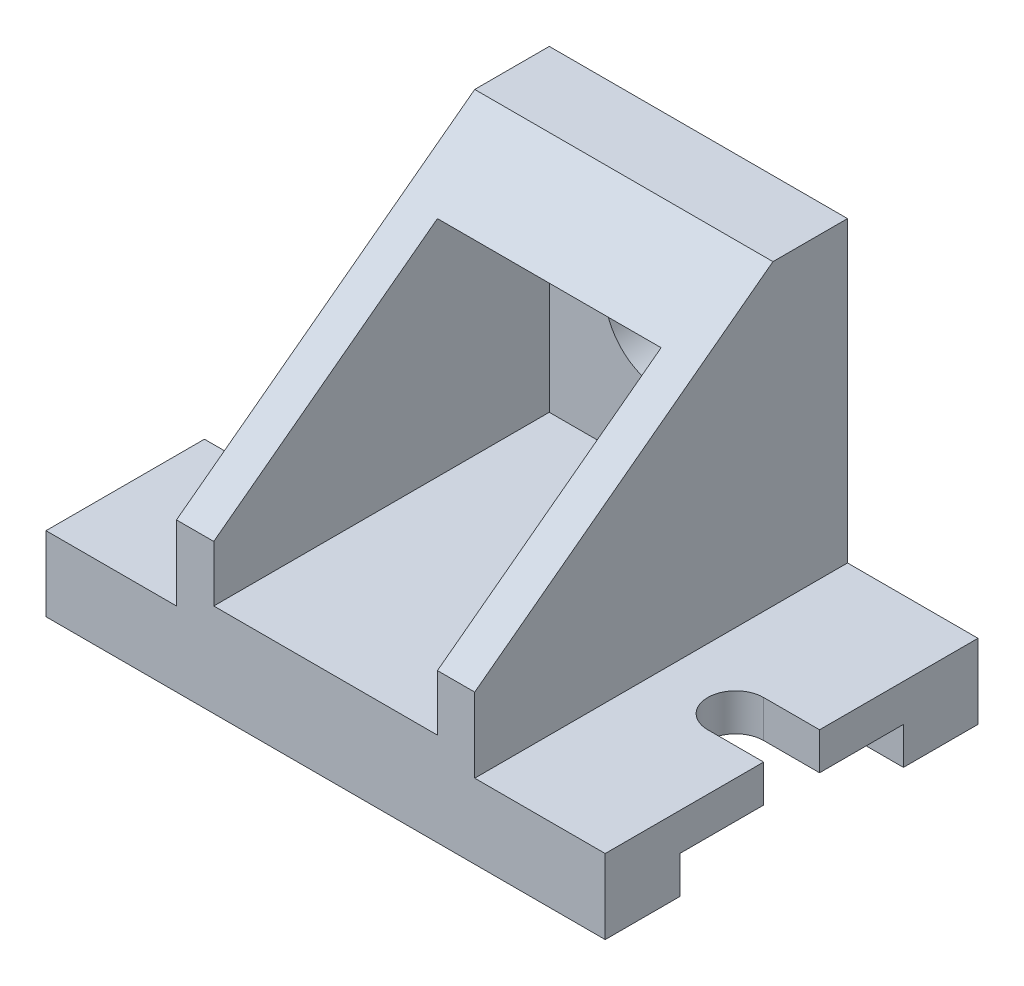
ISO-10303-21;
HEADER;
FILE_DESCRIPTION(('STEP AP214'),'2;1');
FILE_NAME('part.step','',(''),(''),'','','');
FILE_SCHEMA(('AUTOMOTIVE_DESIGN { 1 0 10303 214 1 1 1 1 }'));
ENDSEC;
DATA;
#1=APPLICATION_CONTEXT('core data for automotive mechanical design processes');
#2=APPLICATION_PROTOCOL_DEFINITION('international standard','automotive_design',2000,#1);
#3=PRODUCT_CONTEXT('',#1,'mechanical');
#4=PRODUCT('Part','Part','',(#3));
#5=PRODUCT_RELATED_PRODUCT_CATEGORY('part','',(#4));
#6=PRODUCT_DEFINITION_FORMATION('','',#4);
#7=PRODUCT_DEFINITION_CONTEXT('part definition',#1,'design');
#8=PRODUCT_DEFINITION('design','',#6,#7);
#9=PRODUCT_DEFINITION_SHAPE('','',#8);
#10=(LENGTH_UNIT() NAMED_UNIT(*) SI_UNIT(.MILLI.,.METRE.));
#11=(NAMED_UNIT(*) PLANE_ANGLE_UNIT() SI_UNIT($,.RADIAN.));
#12=(NAMED_UNIT(*) SI_UNIT($,.STERADIAN.) SOLID_ANGLE_UNIT());
#13=UNCERTAINTY_MEASURE_WITH_UNIT(LENGTH_MEASURE(1.E-05),#10,'distance_accuracy_value','');
#14=(GEOMETRIC_REPRESENTATION_CONTEXT(3) GLOBAL_UNCERTAINTY_ASSIGNED_CONTEXT((#13)) GLOBAL_UNIT_ASSIGNED_CONTEXT((#10,
#11,#12)) REPRESENTATION_CONTEXT('',''));
#15=CARTESIAN_POINT('',(0.,0.,0.));
#16=DIRECTION('',(0.,0.,1.));
#17=DIRECTION('',(1.,0.,0.));
#18=AXIS2_PLACEMENT_3D('',#15,#16,#17);
#19=CARTESIAN_POINT('',(0.,20.,0.));
#20=DIRECTION('',(0.,1.,0.));
#21=DIRECTION('',(0.,0.,1.));
#22=AXIS2_PLACEMENT_3D('',#19,#20,#21);
#23=PLANE('',#22);
#24=DIRECTION('',(1.,0.,0.));
#25=VECTOR('',#24,1.);
#26=CARTESIAN_POINT('',(-75.,20.,50.));
#27=LINE('',#26,#25);
#28=CARTESIAN_POINT('',(-75.,20.,50.));
#29=VERTEX_POINT('',#28);
#30=CARTESIAN_POINT('',(-40.,20.,50.));
#31=VERTEX_POINT('',#30);
#32=EDGE_CURVE('E357',#29,#31,#27,.T.);
#33=ORIENTED_EDGE('',*,*,#32,.T.);
#34=DIRECTION('',(0.,0.,-1.));
#35=VECTOR('',#34,1.);
#36=CARTESIAN_POINT('',(-40.,20.,50.));
#37=LINE('',#36,#35);
#38=CARTESIAN_POINT('',(-40.,20.,-50.));
#39=VERTEX_POINT('',#38);
#40=EDGE_CURVE('E57',#31,#39,#37,.T.);
#41=ORIENTED_EDGE('',*,*,#40,.T.);
#42=DIRECTION('',(-1.,0.,0.));
#43=VECTOR('',#42,1.);
#44=CARTESIAN_POINT('',(-75.,20.,-50.));
#45=LINE('',#44,#43);
#46=CARTESIAN_POINT('',(-75.,20.,-50.));
#47=VERTEX_POINT('',#46);
#48=EDGE_CURVE('E348',#39,#47,#45,.T.);
#49=ORIENTED_EDGE('',*,*,#48,.T.);
#50=DIRECTION('',(0.,0.,1.));
#51=VECTOR('',#50,1.);
#52=CARTESIAN_POINT('',(-75.,20.,-50.));
#53=LINE('',#52,#51);
#54=CARTESIAN_POINT('',(-75.,20.,-7.50000000000001));
#55=VERTEX_POINT('',#54);
#56=EDGE_CURVE('E353',#47,#55,#53,.T.);
#57=ORIENTED_EDGE('',*,*,#56,.T.);
#58=DIRECTION('',(-1.,0.,0.));
#59=VECTOR('',#58,1.);
#60=CARTESIAN_POINT('',(-60.,20.,-7.50000000000001));
#61=LINE('',#60,#59);
#62=CARTESIAN_POINT('',(-60.,20.,-7.50000000000001));
#63=VERTEX_POINT('',#62);
#64=EDGE_CURVE('E284',#63,#55,#61,.T.);
#65=ORIENTED_EDGE('',*,*,#64,.F.);
#66=CARTESIAN_POINT('',(-60.,20.,0.));
#67=DIRECTION('',(0.,1.,0.));
#68=DIRECTION('',(0.,0.,1.));
#69=AXIS2_PLACEMENT_3D('',#66,#67,#68);
#70=CIRCLE('',#69,7.5);
#71=CARTESIAN_POINT('',(-60.,20.,7.49999999999999));
#72=VERTEX_POINT('',#71);
#73=EDGE_CURVE('E281',#72,#63,#70,.T.);
#74=ORIENTED_EDGE('',*,*,#73,.F.);
#75=DIRECTION('',(1.,0.,0.));
#76=VECTOR('',#75,1.);
#77=CARTESIAN_POINT('',(-60.,20.,7.49999999999999));
#78=LINE('',#77,#76);
#79=CARTESIAN_POINT('',(-75.,20.,7.49999999999999));
#80=VERTEX_POINT('',#79);
#81=EDGE_CURVE('E286',#80,#72,#78,.T.);
#82=ORIENTED_EDGE('',*,*,#81,.F.);
#83=EDGE_CURVE('E352',#80,#29,#53,.T.);
#84=ORIENTED_EDGE('',*,*,#83,.T.);
#85=EDGE_LOOP('',(#33,#41,#49,#57,#65,#74,#82,#84));
#86=FACE_BOUND('',#85,.T.);
#87=ADVANCED_FACE('F33',(#86),#23,.T.);
#88=CARTESIAN_POINT('',(-75.,20.,-50.));
#89=DIRECTION('',(1.,0.,0.));
#90=DIRECTION('',(0.,0.,-1.));
#91=AXIS2_PLACEMENT_3D('',#88,#89,#90);
#92=PLANE('',#91);
#93=ORIENTED_EDGE('',*,*,#83,.F.);
#94=DIRECTION('',(0.,1.,0.));
#95=VECTOR('',#94,1.);
#96=CARTESIAN_POINT('',(-75.,0.,7.49999999999999));
#97=LINE('',#96,#95);
#98=CARTESIAN_POINT('',(-75.,10.,7.49999999999999));
#99=VERTEX_POINT('',#98);
#100=EDGE_CURVE('E293',#99,#80,#97,.T.);
#101=ORIENTED_EDGE('',*,*,#100,.F.);
#102=DIRECTION('',(0.,0.,-1.));
#103=VECTOR('',#102,1.);
#104=CARTESIAN_POINT('',(-75.,10.,-30.));
#105=LINE('',#104,#103);
#106=CARTESIAN_POINT('',(-75.,10.,30.));
#107=VERTEX_POINT('',#106);
#108=EDGE_CURVE('E331',#107,#99,#105,.T.);
#109=ORIENTED_EDGE('',*,*,#108,.F.);
#110=DIRECTION('',(0.,1.,0.));
#111=VECTOR('',#110,1.);
#112=CARTESIAN_POINT('',(-75.,10.,30.));
#113=LINE('',#112,#111);
#114=CARTESIAN_POINT('',(-75.,0.,30.));
#115=VERTEX_POINT('',#114);
#116=EDGE_CURVE('E309',#115,#107,#113,.T.);
#117=ORIENTED_EDGE('',*,*,#116,.F.);
#118=DIRECTION('',(0.,0.,1.));
#119=VECTOR('',#118,1.);
#120=CARTESIAN_POINT('',(-75.,0.,-50.));
#121=LINE('',#120,#119);
#122=CARTESIAN_POINT('',(-75.,0.,50.));
#123=VERTEX_POINT('',#122);
#124=EDGE_CURVE('E365',#115,#123,#121,.T.);
#125=ORIENTED_EDGE('',*,*,#124,.T.);
#126=DIRECTION('',(0.,-1.,0.));
#127=VECTOR('',#126,1.);
#128=CARTESIAN_POINT('',(-75.,20.,50.));
#129=LINE('',#128,#127);
#130=EDGE_CURVE('E373',#29,#123,#129,.T.);
#131=ORIENTED_EDGE('',*,*,#130,.F.);
#132=EDGE_LOOP('',(#93,#101,#109,#117,#125,#131));
#133=FACE_BOUND('',#132,.T.);
#134=ADVANCED_FACE('F427',(#133),#92,.F.);
#135=CARTESIAN_POINT('',(75.,20.,-50.));
#136=DIRECTION('',(-1.,0.,0.));
#137=DIRECTION('',(0.,0.,1.));
#138=AXIS2_PLACEMENT_3D('',#135,#136,#137);
#139=PLANE('',#138);
#140=DIRECTION('',(0.,0.,-1.));
#141=VECTOR('',#140,1.);
#142=CARTESIAN_POINT('',(75.,20.,-50.));
#143=LINE('',#142,#141);
#144=CARTESIAN_POINT('',(75.,20.,-7.50000000000001));
#145=VERTEX_POINT('',#144);
#146=CARTESIAN_POINT('',(75.,20.,-50.));
#147=VERTEX_POINT('',#146);
#148=EDGE_CURVE('E349',#145,#147,#143,.T.);
#149=ORIENTED_EDGE('',*,*,#148,.F.);
#150=DIRECTION('',(0.,1.,0.));
#151=VECTOR('',#150,1.);
#152=CARTESIAN_POINT('',(75.,0.,-7.50000000000001));
#153=LINE('',#152,#151);
#154=CARTESIAN_POINT('',(75.,10.,-7.50000000000001));
#155=VERTEX_POINT('',#154);
#156=EDGE_CURVE('E307',#155,#145,#153,.T.);
#157=ORIENTED_EDGE('',*,*,#156,.F.);
#158=DIRECTION('',(0.,0.,-1.));
#159=VECTOR('',#158,1.);
#160=CARTESIAN_POINT('',(75.,10.,-30.));
#161=LINE('',#160,#159);
#162=CARTESIAN_POINT('',(75.,10.,-30.));
#163=VERTEX_POINT('',#162);
#164=EDGE_CURVE('E319',#155,#163,#161,.T.);
#165=ORIENTED_EDGE('',*,*,#164,.T.);
#166=DIRECTION('',(0.,-1.,0.));
#167=VECTOR('',#166,1.);
#168=CARTESIAN_POINT('',(75.,10.,-30.));
#169=LINE('',#168,#167);
#170=CARTESIAN_POINT('',(75.,0.,-30.));
#171=VERTEX_POINT('',#170);
#172=EDGE_CURVE('E324',#163,#171,#169,.T.);
#173=ORIENTED_EDGE('',*,*,#172,.T.);
#174=DIRECTION('',(0.,0.,-1.));
#175=VECTOR('',#174,1.);
#176=CARTESIAN_POINT('',(75.,0.,-50.));
#177=LINE('',#176,#175);
#178=CARTESIAN_POINT('',(75.,0.,-50.));
#179=VERTEX_POINT('',#178);
#180=EDGE_CURVE('E338',#171,#179,#177,.T.);
#181=ORIENTED_EDGE('',*,*,#180,.T.);
#182=DIRECTION('',(0.,-1.,0.));
#183=VECTOR('',#182,1.);
#184=CARTESIAN_POINT('',(75.,20.,-50.));
#185=LINE('',#184,#183);
#186=EDGE_CURVE('E379',#147,#179,#185,.T.);
#187=ORIENTED_EDGE('',*,*,#186,.F.);
#188=EDGE_LOOP('',(#149,#157,#165,#173,#181,#187));
#189=FACE_BOUND('',#188,.T.);
#190=ADVANCED_FACE('F492',(#189),#139,.F.);
#191=CARTESIAN_POINT('',(0.,0.,0.));
#192=DIRECTION('',(0.,1.,0.));
#193=DIRECTION('',(0.,0.,1.));
#194=AXIS2_PLACEMENT_3D('',#191,#192,#193);
#195=PLANE('',#194);
#196=ORIENTED_EDGE('',*,*,#180,.F.);
#197=DIRECTION('',(-1.,0.,0.));
#198=VECTOR('',#197,1.);
#199=CARTESIAN_POINT('',(75.,0.,-30.));
#200=LINE('',#199,#198);
#201=CARTESIAN_POINT('',(-75.,0.,-30.));
#202=VERTEX_POINT('',#201);
#203=EDGE_CURVE('E335',#171,#202,#200,.T.);
#204=ORIENTED_EDGE('',*,*,#203,.T.);
#205=CARTESIAN_POINT('',(-75.,0.,-50.));
#206=VERTEX_POINT('',#205);
#207=EDGE_CURVE('E366',#206,#202,#121,.T.);
#208=ORIENTED_EDGE('',*,*,#207,.F.);
#209=DIRECTION('',(-1.,0.,0.));
#210=VECTOR('',#209,1.);
#211=CARTESIAN_POINT('',(-75.,0.,-50.));
#212=LINE('',#211,#210);
#213=EDGE_CURVE('E363',#179,#206,#212,.T.);
#214=ORIENTED_EDGE('',*,*,#213,.F.);
#215=EDGE_LOOP('',(#196,#204,#208,#214));
#216=FACE_BOUND('',#215,.T.);
#217=ADVANCED_FACE('F500',(#216),#195,.F.);
#218=CARTESIAN_POINT('',(75.,10.,30.));
#219=VERTEX_POINT('',#218);
#220=CARTESIAN_POINT('',(75.,10.,7.49999999999999));
#221=VERTEX_POINT('',#220);
#222=EDGE_CURVE('E321',#219,#221,#161,.T.);
#223=ORIENTED_EDGE('',*,*,#222,.T.);
#224=DIRECTION('',(0.,1.,0.));
#225=VECTOR('',#224,1.);
#226=CARTESIAN_POINT('',(75.,0.,7.49999999999999));
#227=LINE('',#226,#225);
#228=CARTESIAN_POINT('',(75.,20.,7.49999999999999));
#229=VERTEX_POINT('',#228);
#230=EDGE_CURVE('E310',#221,#229,#227,.T.);
#231=ORIENTED_EDGE('',*,*,#230,.T.);
#232=CARTESIAN_POINT('',(75.,20.,50.));
#233=VERTEX_POINT('',#232);
#234=EDGE_CURVE('E345',#233,#229,#143,.T.);
#235=ORIENTED_EDGE('',*,*,#234,.F.);
#236=DIRECTION('',(0.,-1.,0.));
#237=VECTOR('',#236,1.);
#238=CARTESIAN_POINT('',(75.,20.,50.));
#239=LINE('',#238,#237);
#240=CARTESIAN_POINT('',(75.,0.,50.));
#241=VERTEX_POINT('',#240);
#242=EDGE_CURVE('E359',#233,#241,#239,.T.);
#243=ORIENTED_EDGE('',*,*,#242,.T.);
#244=CARTESIAN_POINT('',(75.,0.,30.));
#245=VERTEX_POINT('',#244);
#246=EDGE_CURVE('E360',#241,#245,#177,.T.);
#247=ORIENTED_EDGE('',*,*,#246,.T.);
#248=DIRECTION('',(0.,1.,0.));
#249=VECTOR('',#248,1.);
#250=CARTESIAN_POINT('',(75.,10.,30.));
#251=LINE('',#250,#249);
#252=EDGE_CURVE('E316',#245,#219,#251,.T.);
#253=ORIENTED_EDGE('',*,*,#252,.T.);
#254=EDGE_LOOP('',(#223,#231,#235,#243,#247,#253));
#255=FACE_BOUND('',#254,.T.);
#256=ADVANCED_FACE('F35',(#255),#139,.F.);
#257=CARTESIAN_POINT('',(-75.,20.,-50.));
#258=DIRECTION('',(0.,0.,1.));
#259=DIRECTION('',(1.,0.,0.));
#260=AXIS2_PLACEMENT_3D('',#257,#258,#259);
#261=PLANE('',#260);
#262=CARTESIAN_POINT('',(0.,60.,-50.));
#263=DIRECTION('',(0.,0.,-1.));
#264=DIRECTION('',(-1.,0.,0.));
#265=AXIS2_PLACEMENT_3D('',#262,#263,#264);
#266=CIRCLE('',#265,15.);
#267=CARTESIAN_POINT('',(-15.,60.,-50.));
#268=VERTEX_POINT('',#267);
#269=EDGE_CURVE('E236',#268,#268,#266,.T.);
#270=ORIENTED_EDGE('',*,*,#269,.F.);
#271=EDGE_LOOP('',(#270));
#272=FACE_BOUND('',#271,.T.);
#273=ORIENTED_EDGE('',*,*,#213,.T.);
#274=DIRECTION('',(0.,-1.,0.));
#275=VECTOR('',#274,1.);
#276=CARTESIAN_POINT('',(-75.,20.,-50.));
#277=LINE('',#276,#275);
#278=EDGE_CURVE('E376',#47,#206,#277,.T.);
#279=ORIENTED_EDGE('',*,*,#278,.F.);
#280=ORIENTED_EDGE('',*,*,#48,.F.);
#281=DIRECTION('',(0.,1.,0.));
#282=VECTOR('',#281,1.);
#283=CARTESIAN_POINT('',(-40.,20.,-50.));
#284=LINE('',#283,#282);
#285=CARTESIAN_POINT('',(-40.,100.,-50.));
#286=VERTEX_POINT('',#285);
#287=EDGE_CURVE('E263',#39,#286,#284,.T.);
#288=ORIENTED_EDGE('',*,*,#287,.T.);
#289=DIRECTION('',(-1.,0.,0.));
#290=VECTOR('',#289,1.);
#291=CARTESIAN_POINT('',(40.,100.,-50.));
#292=LINE('',#291,#290);
#293=CARTESIAN_POINT('',(40.,100.,-50.));
#294=VERTEX_POINT('',#293);
#295=EDGE_CURVE('E278',#294,#286,#292,.T.);
#296=ORIENTED_EDGE('',*,*,#295,.F.);
#297=DIRECTION('',(0.,1.,0.));
#298=VECTOR('',#297,1.);
#299=CARTESIAN_POINT('',(40.,20.,-50.));
#300=LINE('',#299,#298);
#301=CARTESIAN_POINT('',(40.,20.,-50.));
#302=VERTEX_POINT('',#301);
#303=EDGE_CURVE('E251',#302,#294,#300,.T.);
#304=ORIENTED_EDGE('',*,*,#303,.F.);
#305=EDGE_CURVE('E350',#147,#302,#45,.T.);
#306=ORIENTED_EDGE('',*,*,#305,.F.);
#307=ORIENTED_EDGE('',*,*,#186,.T.);
#308=EDGE_LOOP('',(#273,#279,#280,#288,#296,#304,#306,#307));
#309=FACE_BOUND('',#308,.T.);
#310=ADVANCED_FACE('F452',(#272,#309),#261,.F.);
#311=CARTESIAN_POINT('',(-75.,10.,-7.50000000000001));
#312=VERTEX_POINT('',#311);
#313=CARTESIAN_POINT('',(-75.,10.,-30.));
#314=VERTEX_POINT('',#313);
#315=EDGE_CURVE('E330',#312,#314,#105,.T.);
#316=ORIENTED_EDGE('',*,*,#315,.F.);
#317=DIRECTION('',(0.,1.,0.));
#318=VECTOR('',#317,1.);
#319=CARTESIAN_POINT('',(-75.,0.,-7.50000000000001));
#320=LINE('',#319,#318);
#321=EDGE_CURVE('E295',#312,#55,#320,.T.);
#322=ORIENTED_EDGE('',*,*,#321,.T.);
#323=ORIENTED_EDGE('',*,*,#56,.F.);
#324=ORIENTED_EDGE('',*,*,#278,.T.);
#325=ORIENTED_EDGE('',*,*,#207,.T.);
#326=DIRECTION('',(0.,-1.,0.));
#327=VECTOR('',#326,1.);
#328=CARTESIAN_POINT('',(-75.,10.,-30.));
#329=LINE('',#328,#327);
#330=EDGE_CURVE('E320',#314,#202,#329,.T.);
#331=ORIENTED_EDGE('',*,*,#330,.F.);
#332=EDGE_LOOP('',(#316,#322,#323,#324,#325,#331));
#333=FACE_BOUND('',#332,.T.);
#334=ADVANCED_FACE('F458',(#333),#92,.F.);
#335=CARTESIAN_POINT('',(-75.,20.,50.));
#336=DIRECTION('',(0.,0.,-1.));
#337=DIRECTION('',(-1.,0.,0.));
#338=AXIS2_PLACEMENT_3D('',#335,#336,#337);
#339=PLANE('',#338);
#340=DIRECTION('',(1.,0.,0.));
#341=VECTOR('',#340,1.);
#342=CARTESIAN_POINT('',(-30.,25.,50.));
#343=LINE('',#342,#341);
#344=CARTESIAN_POINT('',(-30.,25.,50.));
#345=VERTEX_POINT('',#344);
#346=CARTESIAN_POINT('',(30.,25.,50.));
#347=VERTEX_POINT('',#346);
#348=EDGE_CURVE('E233',#345,#347,#343,.T.);
#349=ORIENTED_EDGE('',*,*,#348,.F.);
#350=DIRECTION('',(0.,-1.,0.));
#351=VECTOR('',#350,1.);
#352=CARTESIAN_POINT('',(-30.,25.,50.));
#353=LINE('',#352,#351);
#354=CARTESIAN_POINT('',(-30.,40.,50.));
#355=VERTEX_POINT('',#354);
#356=EDGE_CURVE('E215',#355,#345,#353,.T.);
#357=ORIENTED_EDGE('',*,*,#356,.F.);
#358=DIRECTION('',(-1.,0.,0.));
#359=VECTOR('',#358,1.);
#360=CARTESIAN_POINT('',(40.,40.,50.));
#361=LINE('',#360,#359);
#362=CARTESIAN_POINT('',(-40.,40.,50.));
#363=VERTEX_POINT('',#362);
#364=EDGE_CURVE('E261',#355,#363,#361,.T.);
#365=ORIENTED_EDGE('',*,*,#364,.T.);
#366=DIRECTION('',(0.,-1.,0.));
#367=VECTOR('',#366,1.);
#368=CARTESIAN_POINT('',(-40.,40.,50.));
#369=LINE('',#368,#367);
#370=EDGE_CURVE('E252',#363,#31,#369,.T.);
#371=ORIENTED_EDGE('',*,*,#370,.T.);
#372=ORIENTED_EDGE('',*,*,#32,.F.);
#373=ORIENTED_EDGE('',*,*,#130,.T.);
#374=DIRECTION('',(1.,0.,0.));
#375=VECTOR('',#374,1.);
#376=CARTESIAN_POINT('',(-75.,0.,50.));
#377=LINE('',#376,#375);
#378=EDGE_CURVE('E369',#123,#241,#377,.T.);
#379=ORIENTED_EDGE('',*,*,#378,.T.);
#380=ORIENTED_EDGE('',*,*,#242,.F.);
#381=CARTESIAN_POINT('',(40.,20.,50.));
#382=VERTEX_POINT('',#381);
#383=EDGE_CURVE('E356',#382,#233,#27,.T.);
#384=ORIENTED_EDGE('',*,*,#383,.F.);
#385=DIRECTION('',(0.,-1.,0.));
#386=VECTOR('',#385,1.);
#387=CARTESIAN_POINT('',(40.,40.,50.));
#388=LINE('',#387,#386);
#389=CARTESIAN_POINT('',(40.,40.,50.));
#390=VERTEX_POINT('',#389);
#391=EDGE_CURVE('E258',#390,#382,#388,.T.);
#392=ORIENTED_EDGE('',*,*,#391,.F.);
#393=CARTESIAN_POINT('',(30.,40.,50.));
#394=VERTEX_POINT('',#393);
#395=EDGE_CURVE('E272',#390,#394,#361,.T.);
#396=ORIENTED_EDGE('',*,*,#395,.T.);
#397=DIRECTION('',(0.,1.,0.));
#398=VECTOR('',#397,1.);
#399=CARTESIAN_POINT('',(30.,25.,50.));
#400=LINE('',#399,#398);
#401=EDGE_CURVE('E49',#347,#394,#400,.T.);
#402=ORIENTED_EDGE('',*,*,#401,.F.);
#403=EDGE_LOOP('',(#349,#357,#365,#371,#372,#373,#379,#380,#384,#392,#396,#402));
#404=FACE_BOUND('',#403,.T.);
#405=ADVANCED_FACE('F410',(#404),#339,.F.);
#406=DIRECTION('',(0.,0.,-1.));
#407=VECTOR('',#406,1.);
#408=CARTESIAN_POINT('',(40.,20.,50.));
#409=LINE('',#408,#407);
#410=EDGE_CURVE('E248',#382,#302,#409,.T.);
#411=ORIENTED_EDGE('',*,*,#410,.F.);
#412=ORIENTED_EDGE('',*,*,#383,.T.);
#413=ORIENTED_EDGE('',*,*,#234,.T.);
#414=DIRECTION('',(1.,0.,0.));
#415=VECTOR('',#414,1.);
#416=CARTESIAN_POINT('',(60.,20.,7.49999999999999));
#417=LINE('',#416,#415);
#418=CARTESIAN_POINT('',(60.,20.,7.49999999999999));
#419=VERTEX_POINT('',#418);
#420=EDGE_CURVE('E304',#419,#229,#417,.T.);
#421=ORIENTED_EDGE('',*,*,#420,.F.);
#422=CARTESIAN_POINT('',(60.,20.,0.));
#423=DIRECTION('',(0.,1.,0.));
#424=DIRECTION('',(0.,0.,-1.));
#425=AXIS2_PLACEMENT_3D('',#422,#423,#424);
#426=CIRCLE('',#425,7.5);
#427=CARTESIAN_POINT('',(60.,20.,-7.50000000000001));
#428=VERTEX_POINT('',#427);
#429=EDGE_CURVE('E301',#428,#419,#426,.T.);
#430=ORIENTED_EDGE('',*,*,#429,.F.);
#431=DIRECTION('',(-1.,0.,0.));
#432=VECTOR('',#431,1.);
#433=CARTESIAN_POINT('',(60.,20.,-7.50000000000001));
#434=LINE('',#433,#432);
#435=EDGE_CURVE('E292',#145,#428,#434,.T.);
#436=ORIENTED_EDGE('',*,*,#435,.F.);
#437=ORIENTED_EDGE('',*,*,#148,.T.);
#438=ORIENTED_EDGE('',*,*,#305,.T.);
#439=EDGE_LOOP('',(#411,#412,#413,#421,#430,#436,#437,#438));
#440=FACE_BOUND('',#439,.T.);
#441=ADVANCED_FACE('F441',(#440),#23,.T.);
#442=ORIENTED_EDGE('',*,*,#124,.F.);
#443=DIRECTION('',(-1.,0.,0.));
#444=VECTOR('',#443,1.);
#445=CARTESIAN_POINT('',(75.,0.,30.));
#446=LINE('',#445,#444);
#447=EDGE_CURVE('E327',#245,#115,#446,.T.);
#448=ORIENTED_EDGE('',*,*,#447,.F.);
#449=ORIENTED_EDGE('',*,*,#246,.F.);
#450=ORIENTED_EDGE('',*,*,#378,.F.);
#451=EDGE_LOOP('',(#442,#448,#449,#450));
#452=FACE_BOUND('',#451,.T.);
#453=ADVANCED_FACE('F433',(#452),#195,.F.);
#454=CARTESIAN_POINT('',(75.,10.,-30.));
#455=DIRECTION('',(0.,0.,-1.));
#456=DIRECTION('',(-1.,0.,0.));
#457=AXIS2_PLACEMENT_3D('',#454,#455,#456);
#458=PLANE('',#457);
#459=ORIENTED_EDGE('',*,*,#330,.T.);
#460=ORIENTED_EDGE('',*,*,#203,.F.);
#461=ORIENTED_EDGE('',*,*,#172,.F.);
#462=DIRECTION('',(-1.,0.,0.));
#463=VECTOR('',#462,1.);
#464=CARTESIAN_POINT('',(75.,10.,-30.));
#465=LINE('',#464,#463);
#466=EDGE_CURVE('E339',#163,#314,#465,.T.);
#467=ORIENTED_EDGE('',*,*,#466,.T.);
#468=EDGE_LOOP('',(#459,#460,#461,#467));
#469=FACE_BOUND('',#468,.T.);
#470=ADVANCED_FACE('F485',(#469),#458,.F.);
#471=CARTESIAN_POINT('',(75.,10.,-30.));
#472=DIRECTION('',(0.,1.,0.));
#473=DIRECTION('',(0.,0.,1.));
#474=AXIS2_PLACEMENT_3D('',#471,#472,#473);
#475=PLANE('',#474);
#476=ORIENTED_EDGE('',*,*,#108,.T.);
#477=DIRECTION('',(1.,0.,0.));
#478=VECTOR('',#477,1.);
#479=CARTESIAN_POINT('',(75.,10.,7.49999999999999));
#480=LINE('',#479,#478);
#481=CARTESIAN_POINT('',(-60.,10.,7.49999999999999));
#482=VERTEX_POINT('',#481);
#483=EDGE_CURVE('E397',#99,#482,#480,.T.);
#484=ORIENTED_EDGE('',*,*,#483,.T.);
#485=CARTESIAN_POINT('',(-60.,10.,0.));
#486=DIRECTION('',(0.,1.,0.));
#487=DIRECTION('',(0.,0.,1.));
#488=AXIS2_PLACEMENT_3D('',#485,#486,#487);
#489=CIRCLE('',#488,7.5);
#490=CARTESIAN_POINT('',(-60.,10.,-7.50000000000001));
#491=VERTEX_POINT('',#490);
#492=EDGE_CURVE('E394',#482,#491,#489,.T.);
#493=ORIENTED_EDGE('',*,*,#492,.T.);
#494=DIRECTION('',(-1.,0.,0.));
#495=VECTOR('',#494,1.);
#496=CARTESIAN_POINT('',(75.,10.,-7.50000000000001));
#497=LINE('',#496,#495);
#498=EDGE_CURVE('E391',#491,#312,#497,.T.);
#499=ORIENTED_EDGE('',*,*,#498,.T.);
#500=ORIENTED_EDGE('',*,*,#315,.T.);
#501=ORIENTED_EDGE('',*,*,#466,.F.);
#502=ORIENTED_EDGE('',*,*,#164,.F.);
#503=DIRECTION('',(-1.,0.,0.));
#504=VECTOR('',#503,1.);
#505=CARTESIAN_POINT('',(75.,10.,-7.50000000000001));
#506=LINE('',#505,#504);
#507=CARTESIAN_POINT('',(60.,10.,-7.50000000000001));
#508=VERTEX_POINT('',#507);
#509=EDGE_CURVE('E388',#155,#508,#506,.T.);
#510=ORIENTED_EDGE('',*,*,#509,.T.);
#511=CARTESIAN_POINT('',(60.,10.,0.));
#512=DIRECTION('',(0.,1.,0.));
#513=DIRECTION('',(0.,0.,1.));
#514=AXIS2_PLACEMENT_3D('',#511,#512,#513);
#515=CIRCLE('',#514,7.5);
#516=CARTESIAN_POINT('',(60.,10.,7.49999999999999));
#517=VERTEX_POINT('',#516);
#518=EDGE_CURVE('E382',#508,#517,#515,.T.);
#519=ORIENTED_EDGE('',*,*,#518,.T.);
#520=DIRECTION('',(1.,0.,0.));
#521=VECTOR('',#520,1.);
#522=CARTESIAN_POINT('',(75.,10.,7.49999999999999));
#523=LINE('',#522,#521);
#524=EDGE_CURVE('E385',#517,#221,#523,.T.);
#525=ORIENTED_EDGE('',*,*,#524,.T.);
#526=ORIENTED_EDGE('',*,*,#222,.F.);
#527=DIRECTION('',(-1.,0.,0.));
#528=VECTOR('',#527,1.);
#529=CARTESIAN_POINT('',(75.,10.,30.));
#530=LINE('',#529,#528);
#531=EDGE_CURVE('E342',#219,#107,#530,.T.);
#532=ORIENTED_EDGE('',*,*,#531,.T.);
#533=EDGE_LOOP('',(#476,#484,#493,#499,#500,#501,#502,#510,#519,#525,#526,#532));
#534=FACE_BOUND('',#533,.T.);
#535=ADVANCED_FACE('F465',(#534),#475,.F.);
#536=CARTESIAN_POINT('',(75.,10.,30.));
#537=DIRECTION('',(0.,0.,1.));
#538=DIRECTION('',(1.,0.,0.));
#539=AXIS2_PLACEMENT_3D('',#536,#537,#538);
#540=PLANE('',#539);
#541=ORIENTED_EDGE('',*,*,#116,.T.);
#542=ORIENTED_EDGE('',*,*,#531,.F.);
#543=ORIENTED_EDGE('',*,*,#252,.F.);
#544=ORIENTED_EDGE('',*,*,#447,.T.);
#545=EDGE_LOOP('',(#541,#542,#543,#544));
#546=FACE_BOUND('',#545,.T.);
#547=ADVANCED_FACE('F474',(#546),#540,.F.);
#548=CARTESIAN_POINT('',(60.,0.,-7.50000000000001));
#549=DIRECTION('',(0.,0.,-1.));
#550=DIRECTION('',(-1.,0.,0.));
#551=AXIS2_PLACEMENT_3D('',#548,#549,#550);
#552=PLANE('',#551);
#553=ORIENTED_EDGE('',*,*,#156,.T.);
#554=ORIENTED_EDGE('',*,*,#435,.T.);
#555=DIRECTION('',(0.,1.,0.));
#556=VECTOR('',#555,1.);
#557=CARTESIAN_POINT('',(60.,0.,-7.50000000000001));
#558=LINE('',#557,#556);
#559=EDGE_CURVE('E306',#508,#428,#558,.T.);
#560=ORIENTED_EDGE('',*,*,#559,.F.);
#561=ORIENTED_EDGE('',*,*,#509,.F.);
#562=EDGE_LOOP('',(#553,#554,#560,#561));
#563=FACE_BOUND('',#562,.T.);
#564=ADVANCED_FACE('F476',(#563),#552,.F.);
#565=CARTESIAN_POINT('',(60.,0.,7.49999999999999));
#566=DIRECTION('',(0.,0.,1.));
#567=DIRECTION('',(1.,0.,0.));
#568=AXIS2_PLACEMENT_3D('',#565,#566,#567);
#569=PLANE('',#568);
#570=DIRECTION('',(0.,1.,0.));
#571=VECTOR('',#570,1.);
#572=CARTESIAN_POINT('',(60.,0.,7.49999999999999));
#573=LINE('',#572,#571);
#574=EDGE_CURVE('E313',#517,#419,#573,.T.);
#575=ORIENTED_EDGE('',*,*,#574,.T.);
#576=ORIENTED_EDGE('',*,*,#420,.T.);
#577=ORIENTED_EDGE('',*,*,#230,.F.);
#578=ORIENTED_EDGE('',*,*,#524,.F.);
#579=EDGE_LOOP('',(#575,#576,#577,#578));
#580=FACE_BOUND('',#579,.T.);
#581=ADVANCED_FACE('F482',(#580),#569,.F.);
#582=CARTESIAN_POINT('',(60.,0.,0.));
#583=DIRECTION('',(0.,1.,0.));
#584=DIRECTION('',(0.,0.,1.));
#585=AXIS2_PLACEMENT_3D('',#582,#583,#584);
#586=CYLINDRICAL_SURFACE('',#585,7.5);
#587=ORIENTED_EDGE('',*,*,#559,.T.);
#588=ORIENTED_EDGE('',*,*,#429,.T.);
#589=ORIENTED_EDGE('',*,*,#574,.F.);
#590=ORIENTED_EDGE('',*,*,#518,.F.);
#591=EDGE_LOOP('',(#587,#588,#589,#590));
#592=FACE_BOUND('',#591,.T.);
#593=ADVANCED_FACE('F548',(#592),#586,.F.);
#594=CARTESIAN_POINT('',(-60.,0.,0.));
#595=DIRECTION('',(0.,1.,0.));
#596=DIRECTION('',(0.,0.,1.));
#597=AXIS2_PLACEMENT_3D('',#594,#595,#596);
#598=CYLINDRICAL_SURFACE('',#597,7.5);
#599=DIRECTION('',(0.,1.,0.));
#600=VECTOR('',#599,1.);
#601=CARTESIAN_POINT('',(-60.,0.,7.49999999999999));
#602=LINE('',#601,#600);
#603=EDGE_CURVE('E290',#482,#72,#602,.T.);
#604=ORIENTED_EDGE('',*,*,#603,.T.);
#605=ORIENTED_EDGE('',*,*,#73,.T.);
#606=DIRECTION('',(0.,1.,0.));
#607=VECTOR('',#606,1.);
#608=CARTESIAN_POINT('',(-60.,0.,-7.50000000000001));
#609=LINE('',#608,#607);
#610=EDGE_CURVE('E289',#491,#63,#609,.T.);
#611=ORIENTED_EDGE('',*,*,#610,.F.);
#612=ORIENTED_EDGE('',*,*,#492,.F.);
#613=EDGE_LOOP('',(#604,#605,#611,#612));
#614=FACE_BOUND('',#613,.T.);
#615=ADVANCED_FACE('F469',(#614),#598,.F.);
#616=CARTESIAN_POINT('',(-60.,0.,7.49999999999999));
#617=DIRECTION('',(0.,0.,1.));
#618=DIRECTION('',(1.,0.,0.));
#619=AXIS2_PLACEMENT_3D('',#616,#617,#618);
#620=PLANE('',#619);
#621=ORIENTED_EDGE('',*,*,#100,.T.);
#622=ORIENTED_EDGE('',*,*,#81,.T.);
#623=ORIENTED_EDGE('',*,*,#603,.F.);
#624=ORIENTED_EDGE('',*,*,#483,.F.);
#625=EDGE_LOOP('',(#621,#622,#623,#624));
#626=FACE_BOUND('',#625,.T.);
#627=ADVANCED_FACE('F471',(#626),#620,.F.);
#628=CARTESIAN_POINT('',(-60.,0.,-7.50000000000001));
#629=DIRECTION('',(0.,0.,-1.));
#630=DIRECTION('',(-1.,0.,0.));
#631=AXIS2_PLACEMENT_3D('',#628,#629,#630);
#632=PLANE('',#631);
#633=ORIENTED_EDGE('',*,*,#610,.T.);
#634=ORIENTED_EDGE('',*,*,#64,.T.);
#635=ORIENTED_EDGE('',*,*,#321,.F.);
#636=ORIENTED_EDGE('',*,*,#498,.F.);
#637=EDGE_LOOP('',(#633,#634,#635,#636));
#638=FACE_BOUND('',#637,.T.);
#639=ADVANCED_FACE('F462',(#638),#632,.F.);
#640=CARTESIAN_POINT('',(40.,100.,-50.));
#641=DIRECTION('',(0.,-1.,0.));
#642=DIRECTION('',(0.,0.,-1.));
#643=AXIS2_PLACEMENT_3D('',#640,#641,#642);
#644=PLANE('',#643);
#645=DIRECTION('',(0.,0.,1.));
#646=VECTOR('',#645,1.);
#647=CARTESIAN_POINT('',(-40.,100.,-50.));
#648=LINE('',#647,#646);
#649=CARTESIAN_POINT('',(-40.,100.,-30.));
#650=VERTEX_POINT('',#649);
#651=EDGE_CURVE('E265',#286,#650,#648,.T.);
#652=ORIENTED_EDGE('',*,*,#651,.T.);
#653=DIRECTION('',(-1.,0.,0.));
#654=VECTOR('',#653,1.);
#655=CARTESIAN_POINT('',(40.,100.,-30.));
#656=LINE('',#655,#654);
#657=CARTESIAN_POINT('',(40.,100.,-30.));
#658=VERTEX_POINT('',#657);
#659=EDGE_CURVE('E275',#658,#650,#656,.T.);
#660=ORIENTED_EDGE('',*,*,#659,.F.);
#661=DIRECTION('',(0.,0.,1.));
#662=VECTOR('',#661,1.);
#663=CARTESIAN_POINT('',(40.,100.,-50.));
#664=LINE('',#663,#662);
#665=EDGE_CURVE('E254',#294,#658,#664,.T.);
#666=ORIENTED_EDGE('',*,*,#665,.F.);
#667=ORIENTED_EDGE('',*,*,#295,.T.);
#668=EDGE_LOOP('',(#652,#660,#666,#667));
#669=FACE_BOUND('',#668,.T.);
#670=ADVANCED_FACE('F450',(#669),#644,.F.);
#671=CARTESIAN_POINT('',(40.,100.,-30.));
#672=DIRECTION('',(0.,-0.8,-0.6));
#673=DIRECTION('',(0.,0.6,-0.8));
#674=AXIS2_PLACEMENT_3D('',#671,#672,#673);
#675=PLANE('',#674);
#676=ORIENTED_EDGE('',*,*,#364,.F.);
#677=DIRECTION('',(0.,0.6,-0.8));
#678=VECTOR('',#677,1.);
#679=CARTESIAN_POINT('',(-30.,100.,-30.));
#680=LINE('',#679,#678);
#681=CARTESIAN_POINT('',(-30.,85.,-10.));
#682=VERTEX_POINT('',#681);
#683=EDGE_CURVE('E11',#355,#682,#680,.T.);
#684=ORIENTED_EDGE('',*,*,#683,.T.);
#685=DIRECTION('',(1.,0.,0.));
#686=VECTOR('',#685,1.);
#687=CARTESIAN_POINT('',(40.,85.,-9.99999999999999));
#688=LINE('',#687,#686);
#689=CARTESIAN_POINT('',(30.,85.,-9.99999999999999));
#690=VERTEX_POINT('',#689);
#691=EDGE_CURVE('E42',#682,#690,#688,.T.);
#692=ORIENTED_EDGE('',*,*,#691,.T.);
#693=DIRECTION('',(0.,-0.6,0.8));
#694=VECTOR('',#693,1.);
#695=CARTESIAN_POINT('',(30.,100.,-30.));
#696=LINE('',#695,#694);
#697=EDGE_CURVE('E400',#690,#394,#696,.T.);
#698=ORIENTED_EDGE('',*,*,#697,.T.);
#699=ORIENTED_EDGE('',*,*,#395,.F.);
#700=DIRECTION('',(0.,-0.6,0.8));
#701=VECTOR('',#700,1.);
#702=CARTESIAN_POINT('',(40.,100.,-30.));
#703=LINE('',#702,#701);
#704=EDGE_CURVE('E256',#658,#390,#703,.T.);
#705=ORIENTED_EDGE('',*,*,#704,.F.);
#706=ORIENTED_EDGE('',*,*,#659,.T.);
#707=DIRECTION('',(0.,-0.6,0.8));
#708=VECTOR('',#707,1.);
#709=CARTESIAN_POINT('',(-40.,100.,-30.));
#710=LINE('',#709,#708);
#711=EDGE_CURVE('E267',#650,#363,#710,.T.);
#712=ORIENTED_EDGE('',*,*,#711,.T.);
#713=EDGE_LOOP('',(#676,#684,#692,#698,#699,#705,#706,#712));
#714=FACE_BOUND('',#713,.T.);
#715=ADVANCED_FACE('F405',(#714),#675,.F.);
#716=CARTESIAN_POINT('',(40.,0.,0.));
#717=DIRECTION('',(1.,0.,0.));
#718=DIRECTION('',(0.,0.,-1.));
#719=AXIS2_PLACEMENT_3D('',#716,#717,#718);
#720=PLANE('',#719);
#721=ORIENTED_EDGE('',*,*,#410,.T.);
#722=ORIENTED_EDGE('',*,*,#303,.T.);
#723=ORIENTED_EDGE('',*,*,#665,.T.);
#724=ORIENTED_EDGE('',*,*,#704,.T.);
#725=ORIENTED_EDGE('',*,*,#391,.T.);
#726=EDGE_LOOP('',(#721,#722,#723,#724,#725));
#727=FACE_BOUND('',#726,.T.);
#728=ADVANCED_FACE('F445',(#727),#720,.T.);
#729=CARTESIAN_POINT('',(-40.,0.,0.));
#730=DIRECTION('',(1.,0.,0.));
#731=DIRECTION('',(0.,0.,-1.));
#732=AXIS2_PLACEMENT_3D('',#729,#730,#731);
#733=PLANE('',#732);
#734=ORIENTED_EDGE('',*,*,#40,.F.);
#735=ORIENTED_EDGE('',*,*,#370,.F.);
#736=ORIENTED_EDGE('',*,*,#711,.F.);
#737=ORIENTED_EDGE('',*,*,#651,.F.);
#738=ORIENTED_EDGE('',*,*,#287,.F.);
#739=EDGE_LOOP('',(#734,#735,#736,#737,#738));
#740=FACE_BOUND('',#739,.T.);
#741=ADVANCED_FACE('F417',(#740),#733,.F.);
#742=CARTESIAN_POINT('',(-30.,25.,-40.));
#743=DIRECTION('',(-1.,0.,0.));
#744=DIRECTION('',(0.,0.,1.));
#745=AXIS2_PLACEMENT_3D('',#742,#743,#744);
#746=PLANE('',#745);
#747=ORIENTED_EDGE('',*,*,#356,.T.);
#748=DIRECTION('',(0.,0.,1.));
#749=VECTOR('',#748,1.);
#750=CARTESIAN_POINT('',(-30.,25.,-40.));
#751=LINE('',#750,#749);
#752=CARTESIAN_POINT('',(-30.,25.,-40.));
#753=VERTEX_POINT('',#752);
#754=EDGE_CURVE('E207',#753,#345,#751,.T.);
#755=ORIENTED_EDGE('',*,*,#754,.F.);
#756=DIRECTION('',(0.,-1.,0.));
#757=VECTOR('',#756,1.);
#758=CARTESIAN_POINT('',(-30.,25.,-40.));
#759=LINE('',#758,#757);
#760=CARTESIAN_POINT('',(-30.,85.,-40.));
#761=VERTEX_POINT('',#760);
#762=EDGE_CURVE('E212',#761,#753,#759,.T.);
#763=ORIENTED_EDGE('',*,*,#762,.F.);
#764=DIRECTION('',(0.,0.,1.));
#765=VECTOR('',#764,1.);
#766=CARTESIAN_POINT('',(-30.,85.,-40.));
#767=LINE('',#766,#765);
#768=EDGE_CURVE('E242',#761,#682,#767,.T.);
#769=ORIENTED_EDGE('',*,*,#768,.T.);
#770=ORIENTED_EDGE('',*,*,#683,.F.);
#771=EDGE_LOOP('',(#747,#755,#763,#769,#770));
#772=FACE_BOUND('',#771,.T.);
#773=ADVANCED_FACE('F209',(#772),#746,.F.);
#774=CARTESIAN_POINT('',(-30.,85.,-40.));
#775=DIRECTION('',(0.,1.,0.));
#776=DIRECTION('',(0.,0.,1.));
#777=AXIS2_PLACEMENT_3D('',#774,#775,#776);
#778=PLANE('',#777);
#779=ORIENTED_EDGE('',*,*,#768,.F.);
#780=DIRECTION('',(-1.,0.,0.));
#781=VECTOR('',#780,1.);
#782=CARTESIAN_POINT('',(-30.,85.,-40.));
#783=LINE('',#782,#781);
#784=CARTESIAN_POINT('',(30.,85.,-40.));
#785=VERTEX_POINT('',#784);
#786=EDGE_CURVE('E220',#785,#761,#783,.T.);
#787=ORIENTED_EDGE('',*,*,#786,.F.);
#788=DIRECTION('',(0.,0.,1.));
#789=VECTOR('',#788,1.);
#790=CARTESIAN_POINT('',(30.,85.,-40.));
#791=LINE('',#790,#789);
#792=EDGE_CURVE('E244',#785,#690,#791,.T.);
#793=ORIENTED_EDGE('',*,*,#792,.T.);
#794=ORIENTED_EDGE('',*,*,#691,.F.);
#795=EDGE_LOOP('',(#779,#787,#793,#794));
#796=FACE_BOUND('',#795,.T.);
#797=ADVANCED_FACE('F408',(#796),#778,.F.);
#798=CARTESIAN_POINT('',(30.,25.,-40.));
#799=DIRECTION('',(1.,0.,0.));
#800=DIRECTION('',(0.,0.,-1.));
#801=AXIS2_PLACEMENT_3D('',#798,#799,#800);
#802=PLANE('',#801);
#803=ORIENTED_EDGE('',*,*,#792,.F.);
#804=DIRECTION('',(0.,1.,0.));
#805=VECTOR('',#804,1.);
#806=CARTESIAN_POINT('',(30.,25.,-40.));
#807=LINE('',#806,#805);
#808=CARTESIAN_POINT('',(30.,25.,-40.));
#809=VERTEX_POINT('',#808);
#810=EDGE_CURVE('E228',#809,#785,#807,.T.);
#811=ORIENTED_EDGE('',*,*,#810,.F.);
#812=DIRECTION('',(0.,0.,1.));
#813=VECTOR('',#812,1.);
#814=CARTESIAN_POINT('',(30.,25.,-40.));
#815=LINE('',#814,#813);
#816=EDGE_CURVE('E219',#809,#347,#815,.T.);
#817=ORIENTED_EDGE('',*,*,#816,.T.);
#818=ORIENTED_EDGE('',*,*,#401,.T.);
#819=ORIENTED_EDGE('',*,*,#697,.F.);
#820=EDGE_LOOP('',(#803,#811,#817,#818,#819));
#821=FACE_BOUND('',#820,.T.);
#822=ADVANCED_FACE('F527',(#821),#802,.F.);
#823=CARTESIAN_POINT('',(-30.,25.,-40.));
#824=DIRECTION('',(0.,-1.,0.));
#825=DIRECTION('',(0.,0.,-1.));
#826=AXIS2_PLACEMENT_3D('',#823,#824,#825);
#827=PLANE('',#826);
#828=ORIENTED_EDGE('',*,*,#348,.T.);
#829=ORIENTED_EDGE('',*,*,#816,.F.);
#830=DIRECTION('',(1.,0.,0.));
#831=VECTOR('',#830,1.);
#832=CARTESIAN_POINT('',(-30.,25.,-40.));
#833=LINE('',#832,#831);
#834=EDGE_CURVE('E223',#753,#809,#833,.T.);
#835=ORIENTED_EDGE('',*,*,#834,.F.);
#836=ORIENTED_EDGE('',*,*,#754,.T.);
#837=EDGE_LOOP('',(#828,#829,#835,#836));
#838=FACE_BOUND('',#837,.T.);
#839=ADVANCED_FACE('F224',(#838),#827,.F.);
#840=CARTESIAN_POINT('',(0.,0.,-40.));
#841=DIRECTION('',(0.,0.,-1.));
#842=DIRECTION('',(-1.,0.,0.));
#843=AXIS2_PLACEMENT_3D('',#840,#841,#842);
#844=PLANE('',#843);
#845=CARTESIAN_POINT('',(0.,60.,-40.));
#846=DIRECTION('',(0.,0.,-1.));
#847=DIRECTION('',(-1.,0.,0.));
#848=AXIS2_PLACEMENT_3D('',#845,#846,#847);
#849=CIRCLE('',#848,15.);
#850=CARTESIAN_POINT('',(-15.,60.,-40.));
#851=VERTEX_POINT('',#850);
#852=EDGE_CURVE('E37',#851,#851,#849,.T.);
#853=ORIENTED_EDGE('',*,*,#852,.T.);
#854=EDGE_LOOP('',(#853));
#855=FACE_BOUND('',#854,.T.);
#856=ORIENTED_EDGE('',*,*,#762,.T.);
#857=ORIENTED_EDGE('',*,*,#834,.T.);
#858=ORIENTED_EDGE('',*,*,#810,.T.);
#859=ORIENTED_EDGE('',*,*,#786,.T.);
#860=EDGE_LOOP('',(#856,#857,#858,#859));
#861=FACE_BOUND('',#860,.T.);
#862=ADVANCED_FACE('F230',(#855,#861),#844,.F.);
#863=CARTESIAN_POINT('',(0.,60.,40.));
#864=DIRECTION('',(0.,0.,-1.));
#865=DIRECTION('',(-1.,0.,0.));
#866=AXIS2_PLACEMENT_3D('',#863,#864,#865);
#867=CYLINDRICAL_SURFACE('',#866,15.);
#868=ORIENTED_EDGE('',*,*,#269,.T.);
#869=EDGE_LOOP('',(#868));
#870=FACE_BOUND('',#869,.T.);
#871=ORIENTED_EDGE('',*,*,#852,.F.);
#872=EDGE_LOOP('',(#871));
#873=FACE_BOUND('',#872,.T.);
#874=ADVANCED_FACE('F517',(#870,#873),#867,.F.);
#875=CLOSED_SHELL('',(#87,#134,#190,#217,#256,#310,#334,#405,#441,#453,#470,#535,#547,#564,#581,
#593,#615,#627,#639,#670,#715,#728,#741,#773,#797,#822,#839,#862,#874));
#876=MANIFOLD_SOLID_BREP('B2',#875);
#877=ADVANCED_BREP_SHAPE_REPRESENTATION('',(#18,#876),#14);
#878=SHAPE_DEFINITION_REPRESENTATION(#9,#877);
ENDSEC;
END-ISO-10303-21;
